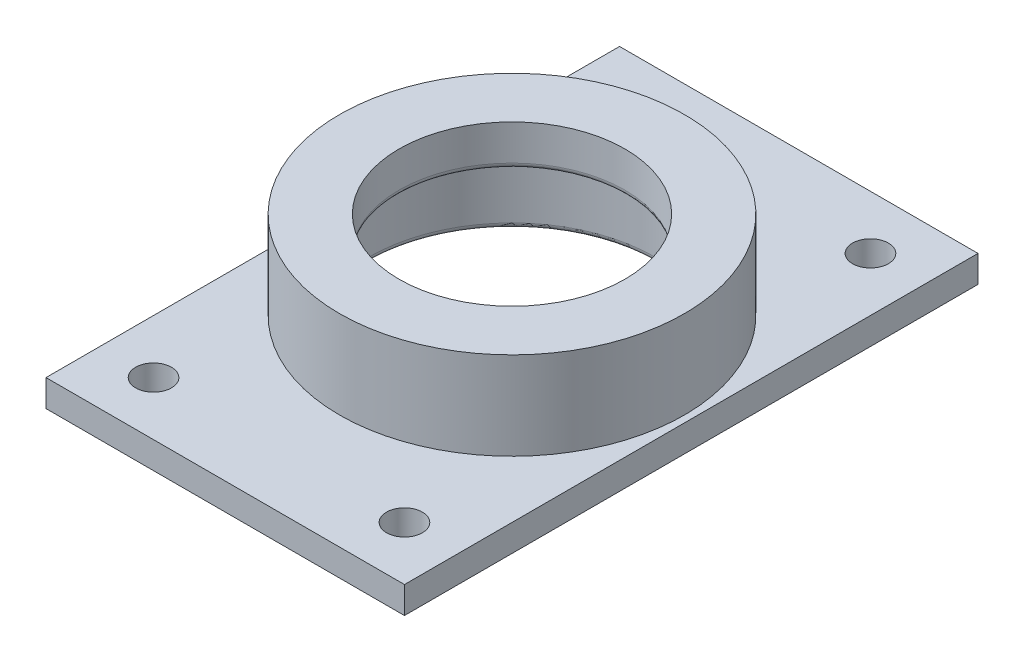
ISO-10303-21;
HEADER;
FILE_DESCRIPTION(('STEP AP214'),'2;1');
FILE_NAME('part.step','',(''),(''),'','','');
FILE_SCHEMA(('AUTOMOTIVE_DESIGN { 1 0 10303 214 1 1 1 1 }'));
ENDSEC;
DATA;
#1=APPLICATION_CONTEXT('core data for automotive mechanical design processes');
#2=APPLICATION_PROTOCOL_DEFINITION('international standard','automotive_design',2000,#1);
#3=PRODUCT_CONTEXT('',#1,'mechanical');
#4=PRODUCT('Part','Part','',(#3));
#5=PRODUCT_RELATED_PRODUCT_CATEGORY('part','',(#4));
#6=PRODUCT_DEFINITION_FORMATION('','',#4);
#7=PRODUCT_DEFINITION_CONTEXT('part definition',#1,'design');
#8=PRODUCT_DEFINITION('design','',#6,#7);
#9=PRODUCT_DEFINITION_SHAPE('','',#8);
#10=(LENGTH_UNIT() NAMED_UNIT(*) SI_UNIT(.MILLI.,.METRE.));
#11=(NAMED_UNIT(*) PLANE_ANGLE_UNIT() SI_UNIT($,.RADIAN.));
#12=(NAMED_UNIT(*) SI_UNIT($,.STERADIAN.) SOLID_ANGLE_UNIT());
#13=UNCERTAINTY_MEASURE_WITH_UNIT(LENGTH_MEASURE(1.E-05),#10,'distance_accuracy_value','');
#14=(GEOMETRIC_REPRESENTATION_CONTEXT(3) GLOBAL_UNCERTAINTY_ASSIGNED_CONTEXT((#13)) GLOBAL_UNIT_ASSIGNED_CONTEXT((#10,
#11,#12)) REPRESENTATION_CONTEXT('',''));
#15=CARTESIAN_POINT('',(0.,0.,0.));
#16=DIRECTION('',(0.,0.,1.));
#17=DIRECTION('',(1.,0.,0.));
#18=AXIS2_PLACEMENT_3D('',#15,#16,#17);
#19=CARTESIAN_POINT('',(0.,20.32,0.));
#20=DIRECTION('',(0.,-1.,0.));
#21=DIRECTION('',(0.,0.,-1.));
#22=AXIS2_PLACEMENT_3D('',#19,#20,#21);
#23=CYLINDRICAL_SURFACE('',#22,30.55);
#24=CARTESIAN_POINT('',(0.,4.7625,0.));
#25=DIRECTION('',(0.,1.,0.));
#26=DIRECTION('',(0.,0.,1.));
#27=AXIS2_PLACEMENT_3D('',#24,#25,#26);
#28=CIRCLE('',#27,30.55);
#29=CARTESIAN_POINT('',(0.,4.7625,30.55));
#30=VERTEX_POINT('',#29);
#31=EDGE_CURVE('E43',#30,#30,#28,.T.);
#32=ORIENTED_EDGE('',*,*,#31,.T.);
#33=EDGE_LOOP('',(#32));
#34=FACE_BOUND('',#33,.T.);
#35=CARTESIAN_POINT('',(0.,20.32,0.));
#36=DIRECTION('',(0.,1.,0.));
#37=DIRECTION('',(0.,0.,1.));
#38=AXIS2_PLACEMENT_3D('',#35,#36,#37);
#39=CIRCLE('',#38,30.55);
#40=CARTESIAN_POINT('',(0.,20.32,30.55));
#41=VERTEX_POINT('',#40);
#42=EDGE_CURVE('E142',#41,#41,#39,.T.);
#43=ORIENTED_EDGE('',*,*,#42,.F.);
#44=EDGE_LOOP('',(#43));
#45=FACE_BOUND('',#44,.T.);
#46=ADVANCED_FACE('F39',(#34,#45),#23,.T.);
#47=CARTESIAN_POINT('',(0.,20.32,0.));
#48=DIRECTION('',(0.,1.,0.));
#49=DIRECTION('',(0.,0.,1.));
#50=AXIS2_PLACEMENT_3D('',#47,#48,#49);
#51=PLANE('',#50);
#52=CARTESIAN_POINT('',(0.,20.32,0.));
#53=DIRECTION('',(0.,1.,0.));
#54=DIRECTION('',(0.,0.,1.));
#55=AXIS2_PLACEMENT_3D('',#52,#53,#54);
#56=CIRCLE('',#55,20.);
#57=CARTESIAN_POINT('',(0.,20.32,20.));
#58=VERTEX_POINT('',#57);
#59=EDGE_CURVE('E134',#58,#58,#56,.T.);
#60=ORIENTED_EDGE('',*,*,#59,.F.);
#61=EDGE_LOOP('',(#60));
#62=FACE_BOUND('',#61,.T.);
#63=ORIENTED_EDGE('',*,*,#42,.T.);
#64=EDGE_LOOP('',(#63));
#65=FACE_BOUND('',#64,.T.);
#66=ADVANCED_FACE('F175',(#62,#65),#51,.T.);
#67=CARTESIAN_POINT('',(0.,0.,0.));
#68=DIRECTION('',(0.,1.,0.));
#69=DIRECTION('',(0.,0.,1.));
#70=AXIS2_PLACEMENT_3D('',#67,#68,#69);
#71=PLANE('',#70);
#72=CARTESIAN_POINT('',(0.,0.,0.));
#73=DIRECTION('',(0.,1.,0.));
#74=DIRECTION('',(0.,0.,1.));
#75=AXIS2_PLACEMENT_3D('',#72,#73,#74);
#76=CIRCLE('',#75,26.404);
#77=CARTESIAN_POINT('',(0.,0.,26.404));
#78=VERTEX_POINT('',#77);
#79=EDGE_CURVE('E150',#78,#78,#76,.T.);
#80=ORIENTED_EDGE('',*,*,#79,.T.);
#81=EDGE_LOOP('',(#80));
#82=FACE_BOUND('',#81,.T.);
#83=DIRECTION('',(0.,0.,-1.));
#84=VECTOR('',#83,1.);
#85=CARTESIAN_POINT('',(-31.75,0.,50.8));
#86=LINE('',#85,#84);
#87=CARTESIAN_POINT('',(-31.75,0.,50.8));
#88=VERTEX_POINT('',#87);
#89=CARTESIAN_POINT('',(-31.75,0.,-50.8));
#90=VERTEX_POINT('',#89);
#91=EDGE_CURVE('E115',#88,#90,#86,.T.);
#92=ORIENTED_EDGE('',*,*,#91,.T.);
#93=DIRECTION('',(1.,0.,0.));
#94=VECTOR('',#93,1.);
#95=CARTESIAN_POINT('',(31.75,0.,-50.8));
#96=LINE('',#95,#94);
#97=CARTESIAN_POINT('',(31.75,0.,-50.8));
#98=VERTEX_POINT('',#97);
#99=EDGE_CURVE('E119',#90,#98,#96,.T.);
#100=ORIENTED_EDGE('',*,*,#99,.T.);
#101=DIRECTION('',(0.,0.,1.));
#102=VECTOR('',#101,1.);
#103=CARTESIAN_POINT('',(31.75,0.,50.8));
#104=LINE('',#103,#102);
#105=CARTESIAN_POINT('',(31.75,0.,50.8));
#106=VERTEX_POINT('',#105);
#107=EDGE_CURVE('E94',#98,#106,#104,.T.);
#108=ORIENTED_EDGE('',*,*,#107,.T.);
#109=DIRECTION('',(-1.,0.,0.));
#110=VECTOR('',#109,1.);
#111=CARTESIAN_POINT('',(31.75,0.,50.8));
#112=LINE('',#111,#110);
#113=EDGE_CURVE('E109',#106,#88,#112,.T.);
#114=ORIENTED_EDGE('',*,*,#113,.T.);
#115=EDGE_LOOP('',(#92,#100,#108,#114));
#116=FACE_BOUND('',#115,.T.);
#117=CARTESIAN_POINT('',(-22.225,0.,41.275));
#118=DIRECTION('',(0.,-1.,0.));
#119=DIRECTION('',(0.,0.,-1.));
#120=AXIS2_PLACEMENT_3D('',#117,#118,#119);
#121=CIRCLE('',#120,3.175);
#122=CARTESIAN_POINT('',(-22.225,0.,38.1));
#123=VERTEX_POINT('',#122);
#124=EDGE_CURVE('E252',#123,#123,#121,.T.);
#125=ORIENTED_EDGE('',*,*,#124,.F.);
#126=EDGE_LOOP('',(#125));
#127=FACE_BOUND('',#126,.T.);
#128=CARTESIAN_POINT('',(22.225,0.,41.275));
#129=DIRECTION('',(0.,-1.,0.));
#130=DIRECTION('',(0.,0.,1.));
#131=AXIS2_PLACEMENT_3D('',#128,#129,#130);
#132=CIRCLE('',#131,3.175);
#133=CARTESIAN_POINT('',(22.225,0.,44.45));
#134=VERTEX_POINT('',#133);
#135=EDGE_CURVE('E244',#134,#134,#132,.T.);
#136=ORIENTED_EDGE('',*,*,#135,.F.);
#137=EDGE_LOOP('',(#136));
#138=FACE_BOUND('',#137,.T.);
#139=CARTESIAN_POINT('',(22.225,0.,-41.275));
#140=DIRECTION('',(0.,-1.,0.));
#141=DIRECTION('',(0.,0.,-1.));
#142=AXIS2_PLACEMENT_3D('',#139,#140,#141);
#143=CIRCLE('',#142,3.175);
#144=CARTESIAN_POINT('',(22.225,0.,-44.45));
#145=VERTEX_POINT('',#144);
#146=EDGE_CURVE('E237',#145,#145,#143,.T.);
#147=ORIENTED_EDGE('',*,*,#146,.F.);
#148=EDGE_LOOP('',(#147));
#149=FACE_BOUND('',#148,.T.);
#150=CARTESIAN_POINT('',(-22.225,0.,-41.275));
#151=DIRECTION('',(0.,-1.,0.));
#152=DIRECTION('',(0.,0.,1.));
#153=AXIS2_PLACEMENT_3D('',#150,#151,#152);
#154=CIRCLE('',#153,3.175);
#155=CARTESIAN_POINT('',(-22.225,0.,-38.1));
#156=VERTEX_POINT('',#155);
#157=EDGE_CURVE('E232',#156,#156,#154,.T.);
#158=ORIENTED_EDGE('',*,*,#157,.F.);
#159=EDGE_LOOP('',(#158));
#160=FACE_BOUND('',#159,.T.);
#161=ADVANCED_FACE('F182',(#82,#116,#127,#138,#149,#160),#71,.F.);
#162=CARTESIAN_POINT('',(0.,13.,0.));
#163=DIRECTION('',(0.,-1.,0.));
#164=DIRECTION('',(0.,0.,-1.));
#165=AXIS2_PLACEMENT_3D('',#162,#163,#164);
#166=CYLINDRICAL_SURFACE('',#165,25.404);
#167=CARTESIAN_POINT('',(0.,0.999999999999999,0.));
#168=DIRECTION('',(0.,1.,0.));
#169=DIRECTION('',(0.,0.,1.));
#170=AXIS2_PLACEMENT_3D('',#167,#168,#169);
#171=CIRCLE('',#170,25.404);
#172=CARTESIAN_POINT('',(0.,0.999999999999999,25.404));
#173=VERTEX_POINT('',#172);
#174=EDGE_CURVE('E146',#173,#173,#171,.F.);
#175=ORIENTED_EDGE('',*,*,#174,.T.);
#176=EDGE_LOOP('',(#175));
#177=FACE_BOUND('',#176,.T.);
#178=CARTESIAN_POINT('',(0.,13.,0.));
#179=DIRECTION('',(0.,-1.,0.));
#180=DIRECTION('',(0.,0.,-1.));
#181=AXIS2_PLACEMENT_3D('',#178,#179,#180);
#182=CIRCLE('',#181,25.404);
#183=CARTESIAN_POINT('',(0.,13.,-25.404));
#184=VERTEX_POINT('',#183);
#185=EDGE_CURVE('E138',#184,#184,#182,.T.);
#186=ORIENTED_EDGE('',*,*,#185,.F.);
#187=EDGE_LOOP('',(#186));
#188=FACE_BOUND('',#187,.T.);
#189=ADVANCED_FACE('F188',(#177,#188),#166,.F.);
#190=CARTESIAN_POINT('',(0.,13.,0.));
#191=DIRECTION('',(0.,-1.,0.));
#192=DIRECTION('',(0.,0.,-1.));
#193=AXIS2_PLACEMENT_3D('',#190,#191,#192);
#194=PLANE('',#193);
#195=CARTESIAN_POINT('',(0.,13.,0.));
#196=DIRECTION('',(0.,-1.,0.));
#197=DIRECTION('',(0.,0.,-1.));
#198=AXIS2_PLACEMENT_3D('',#195,#196,#197);
#199=CIRCLE('',#198,21.);
#200=CARTESIAN_POINT('',(0.,13.,-21.));
#201=VERTEX_POINT('',#200);
#202=EDGE_CURVE('E11',#201,#201,#199,.F.);
#203=ORIENTED_EDGE('',*,*,#202,.T.);
#204=EDGE_LOOP('',(#203));
#205=FACE_BOUND('',#204,.T.);
#206=ORIENTED_EDGE('',*,*,#185,.T.);
#207=EDGE_LOOP('',(#206));
#208=FACE_BOUND('',#207,.T.);
#209=ADVANCED_FACE('F193',(#205,#208),#194,.T.);
#210=CARTESIAN_POINT('',(0.,0.,0.));
#211=DIRECTION('',(0.,1.,0.));
#212=DIRECTION('',(0.,0.,1.));
#213=AXIS2_PLACEMENT_3D('',#210,#211,#212);
#214=CYLINDRICAL_SURFACE('',#213,20.);
#215=CARTESIAN_POINT('',(0.,14.,0.));
#216=DIRECTION('',(0.,-1.,0.));
#217=DIRECTION('',(0.,0.,-1.));
#218=AXIS2_PLACEMENT_3D('',#215,#216,#217);
#219=CIRCLE('',#218,20.);
#220=CARTESIAN_POINT('',(0.,14.,-20.));
#221=VERTEX_POINT('',#220);
#222=EDGE_CURVE('E50',#221,#221,#219,.T.);
#223=ORIENTED_EDGE('',*,*,#222,.T.);
#224=EDGE_LOOP('',(#223));
#225=FACE_BOUND('',#224,.T.);
#226=ORIENTED_EDGE('',*,*,#59,.T.);
#227=EDGE_LOOP('',(#226));
#228=FACE_BOUND('',#227,.T.);
#229=ADVANCED_FACE('F158',(#225,#228),#214,.F.);
#230=CARTESIAN_POINT('',(0.,0.999999999999999,0.));
#231=DIRECTION('',(0.,1.,0.));
#232=DIRECTION('',(0.,0.,1.));
#233=AXIS2_PLACEMENT_3D('',#230,#231,#232);
#234=TOROIDAL_SURFACE('',#233,26.404,1.);
#235=ORIENTED_EDGE('',*,*,#79,.F.);
#236=EDGE_LOOP('',(#235));
#237=FACE_BOUND('',#236,.T.);
#238=ORIENTED_EDGE('',*,*,#174,.F.);
#239=EDGE_LOOP('',(#238));
#240=FACE_BOUND('',#239,.T.);
#241=ADVANCED_FACE('F163',(#237,#240),#234,.T.);
#242=CARTESIAN_POINT('',(0.,14.,0.));
#243=DIRECTION('',(0.,-1.,0.));
#244=DIRECTION('',(0.,0.,-1.));
#245=AXIS2_PLACEMENT_3D('',#242,#243,#244);
#246=TOROIDAL_SURFACE('',#245,21.,1.);
#247=ORIENTED_EDGE('',*,*,#202,.F.);
#248=EDGE_LOOP('',(#247));
#249=FACE_BOUND('',#248,.T.);
#250=ORIENTED_EDGE('',*,*,#222,.F.);
#251=EDGE_LOOP('',(#250));
#252=FACE_BOUND('',#251,.T.);
#253=ADVANCED_FACE('F41',(#249,#252),#246,.T.);
#254=CARTESIAN_POINT('',(-31.75,4.7625,50.8));
#255=DIRECTION('',(-1.,0.,0.));
#256=DIRECTION('',(0.,0.,1.));
#257=AXIS2_PLACEMENT_3D('',#254,#255,#256);
#258=PLANE('',#257);
#259=ORIENTED_EDGE('',*,*,#91,.F.);
#260=DIRECTION('',(0.,-1.,0.));
#261=VECTOR('',#260,1.);
#262=CARTESIAN_POINT('',(-31.75,4.7625,50.8));
#263=LINE('',#262,#261);
#264=CARTESIAN_POINT('',(-31.75,4.7625,50.8));
#265=VERTEX_POINT('',#264);
#266=EDGE_CURVE('E58',#265,#88,#263,.T.);
#267=ORIENTED_EDGE('',*,*,#266,.F.);
#268=DIRECTION('',(0.,0.,-1.));
#269=VECTOR('',#268,1.);
#270=CARTESIAN_POINT('',(-31.75,4.7625,50.8));
#271=LINE('',#270,#269);
#272=CARTESIAN_POINT('',(-31.75,4.7625,-50.8));
#273=VERTEX_POINT('',#272);
#274=EDGE_CURVE('E106',#265,#273,#271,.T.);
#275=ORIENTED_EDGE('',*,*,#274,.T.);
#276=DIRECTION('',(0.,-1.,0.));
#277=VECTOR('',#276,1.);
#278=CARTESIAN_POINT('',(-31.75,4.7625,-50.8));
#279=LINE('',#278,#277);
#280=EDGE_CURVE('E86',#273,#90,#279,.T.);
#281=ORIENTED_EDGE('',*,*,#280,.T.);
#282=EDGE_LOOP('',(#259,#267,#275,#281));
#283=FACE_BOUND('',#282,.T.);
#284=ADVANCED_FACE('F162',(#283),#258,.T.);
#285=CARTESIAN_POINT('',(31.75,4.7625,50.8));
#286=DIRECTION('',(0.,0.,1.));
#287=DIRECTION('',(1.,0.,0.));
#288=AXIS2_PLACEMENT_3D('',#285,#286,#287);
#289=PLANE('',#288);
#290=ORIENTED_EDGE('',*,*,#113,.F.);
#291=DIRECTION('',(0.,-1.,0.));
#292=VECTOR('',#291,1.);
#293=CARTESIAN_POINT('',(31.75,4.7625,50.8));
#294=LINE('',#293,#292);
#295=CARTESIAN_POINT('',(31.75,4.7625,50.8));
#296=VERTEX_POINT('',#295);
#297=EDGE_CURVE('E75',#296,#106,#294,.T.);
#298=ORIENTED_EDGE('',*,*,#297,.F.);
#299=DIRECTION('',(-1.,0.,0.));
#300=VECTOR('',#299,1.);
#301=CARTESIAN_POINT('',(31.75,4.7625,50.8));
#302=LINE('',#301,#300);
#303=EDGE_CURVE('E101',#296,#265,#302,.T.);
#304=ORIENTED_EDGE('',*,*,#303,.T.);
#305=ORIENTED_EDGE('',*,*,#266,.T.);
#306=EDGE_LOOP('',(#290,#298,#304,#305));
#307=FACE_BOUND('',#306,.T.);
#308=ADVANCED_FACE('F170',(#307),#289,.T.);
#309=CARTESIAN_POINT('',(31.75,4.7625,50.8));
#310=DIRECTION('',(1.,0.,0.));
#311=DIRECTION('',(0.,0.,-1.));
#312=AXIS2_PLACEMENT_3D('',#309,#310,#311);
#313=PLANE('',#312);
#314=ORIENTED_EDGE('',*,*,#107,.F.);
#315=DIRECTION('',(0.,-1.,0.));
#316=VECTOR('',#315,1.);
#317=CARTESIAN_POINT('',(31.75,4.7625,-50.8));
#318=LINE('',#317,#316);
#319=CARTESIAN_POINT('',(31.75,4.7625,-50.8));
#320=VERTEX_POINT('',#319);
#321=EDGE_CURVE('E89',#320,#98,#318,.T.);
#322=ORIENTED_EDGE('',*,*,#321,.F.);
#323=DIRECTION('',(0.,0.,1.));
#324=VECTOR('',#323,1.);
#325=CARTESIAN_POINT('',(31.75,4.7625,50.8));
#326=LINE('',#325,#324);
#327=EDGE_CURVE('E92',#320,#296,#326,.T.);
#328=ORIENTED_EDGE('',*,*,#327,.T.);
#329=ORIENTED_EDGE('',*,*,#297,.T.);
#330=EDGE_LOOP('',(#314,#322,#328,#329));
#331=FACE_BOUND('',#330,.T.);
#332=ADVANCED_FACE('F91',(#331),#313,.T.);
#333=CARTESIAN_POINT('',(31.75,4.7625,-50.8));
#334=DIRECTION('',(0.,0.,-1.));
#335=DIRECTION('',(-1.,0.,0.));
#336=AXIS2_PLACEMENT_3D('',#333,#334,#335);
#337=PLANE('',#336);
#338=ORIENTED_EDGE('',*,*,#99,.F.);
#339=ORIENTED_EDGE('',*,*,#280,.F.);
#340=DIRECTION('',(1.,0.,0.));
#341=VECTOR('',#340,1.);
#342=CARTESIAN_POINT('',(31.75,4.7625,-50.8));
#343=LINE('',#342,#341);
#344=EDGE_CURVE('E100',#273,#320,#343,.T.);
#345=ORIENTED_EDGE('',*,*,#344,.T.);
#346=ORIENTED_EDGE('',*,*,#321,.T.);
#347=EDGE_LOOP('',(#338,#339,#345,#346));
#348=FACE_BOUND('',#347,.T.);
#349=ADVANCED_FACE('F104',(#348),#337,.T.);
#350=CARTESIAN_POINT('',(0.,4.7625,0.));
#351=DIRECTION('',(0.,1.,0.));
#352=DIRECTION('',(0.,0.,1.));
#353=AXIS2_PLACEMENT_3D('',#350,#351,#352);
#354=PLANE('',#353);
#355=ORIENTED_EDGE('',*,*,#31,.F.);
#356=EDGE_LOOP('',(#355));
#357=FACE_BOUND('',#356,.T.);
#358=CARTESIAN_POINT('',(-22.225,4.7625,-41.275));
#359=DIRECTION('',(0.,-1.,0.));
#360=DIRECTION('',(0.,0.,1.));
#361=AXIS2_PLACEMENT_3D('',#358,#359,#360);
#362=CIRCLE('',#361,3.175);
#363=CARTESIAN_POINT('',(-22.225,4.7625,-38.1));
#364=VERTEX_POINT('',#363);
#365=EDGE_CURVE('E229',#364,#364,#362,.T.);
#366=ORIENTED_EDGE('',*,*,#365,.T.);
#367=EDGE_LOOP('',(#366));
#368=FACE_BOUND('',#367,.T.);
#369=CARTESIAN_POINT('',(22.225,4.7625,-41.275));
#370=DIRECTION('',(0.,-1.,0.));
#371=DIRECTION('',(0.,0.,-1.));
#372=AXIS2_PLACEMENT_3D('',#369,#370,#371);
#373=CIRCLE('',#372,3.175);
#374=CARTESIAN_POINT('',(22.225,4.7625,-44.45));
#375=VERTEX_POINT('',#374);
#376=EDGE_CURVE('E240',#375,#375,#373,.T.);
#377=ORIENTED_EDGE('',*,*,#376,.T.);
#378=EDGE_LOOP('',(#377));
#379=FACE_BOUND('',#378,.T.);
#380=CARTESIAN_POINT('',(22.225,4.7625,41.275));
#381=DIRECTION('',(0.,-1.,0.));
#382=DIRECTION('',(0.,0.,1.));
#383=AXIS2_PLACEMENT_3D('',#380,#381,#382);
#384=CIRCLE('',#383,3.175);
#385=CARTESIAN_POINT('',(22.225,4.7625,44.45));
#386=VERTEX_POINT('',#385);
#387=EDGE_CURVE('E248',#386,#386,#384,.T.);
#388=ORIENTED_EDGE('',*,*,#387,.T.);
#389=EDGE_LOOP('',(#388));
#390=FACE_BOUND('',#389,.T.);
#391=CARTESIAN_POINT('',(-22.225,4.7625,41.275));
#392=DIRECTION('',(0.,-1.,0.));
#393=DIRECTION('',(0.,0.,-1.));
#394=AXIS2_PLACEMENT_3D('',#391,#392,#393);
#395=CIRCLE('',#394,3.175);
#396=CARTESIAN_POINT('',(-22.225,4.7625,38.1));
#397=VERTEX_POINT('',#396);
#398=EDGE_CURVE('E120',#397,#397,#395,.T.);
#399=ORIENTED_EDGE('',*,*,#398,.T.);
#400=EDGE_LOOP('',(#399));
#401=FACE_BOUND('',#400,.T.);
#402=ORIENTED_EDGE('',*,*,#274,.F.);
#403=ORIENTED_EDGE('',*,*,#303,.F.);
#404=ORIENTED_EDGE('',*,*,#327,.F.);
#405=ORIENTED_EDGE('',*,*,#344,.F.);
#406=EDGE_LOOP('',(#402,#403,#404,#405));
#407=FACE_BOUND('',#406,.T.);
#408=ADVANCED_FACE('F99',(#357,#368,#379,#390,#401,#407),#354,.T.);
#409=CARTESIAN_POINT('',(-22.225,4.7625,41.275));
#410=DIRECTION('',(0.,-1.,0.));
#411=DIRECTION('',(0.,0.,-1.));
#412=AXIS2_PLACEMENT_3D('',#409,#410,#411);
#413=CYLINDRICAL_SURFACE('',#412,3.175);
#414=ORIENTED_EDGE('',*,*,#398,.F.);
#415=EDGE_LOOP('',(#414));
#416=FACE_BOUND('',#415,.T.);
#417=ORIENTED_EDGE('',*,*,#124,.T.);
#418=EDGE_LOOP('',(#417));
#419=FACE_BOUND('',#418,.T.);
#420=ADVANCED_FACE('F208',(#416,#419),#413,.F.);
#421=CARTESIAN_POINT('',(22.225,4.7625,41.275));
#422=DIRECTION('',(0.,-1.,0.));
#423=DIRECTION('',(0.,0.,-1.));
#424=AXIS2_PLACEMENT_3D('',#421,#422,#423);
#425=CYLINDRICAL_SURFACE('',#424,3.175);
#426=ORIENTED_EDGE('',*,*,#387,.F.);
#427=EDGE_LOOP('',(#426));
#428=FACE_BOUND('',#427,.T.);
#429=ORIENTED_EDGE('',*,*,#135,.T.);
#430=EDGE_LOOP('',(#429));
#431=FACE_BOUND('',#430,.T.);
#432=ADVANCED_FACE('F212',(#428,#431),#425,.F.);
#433=CARTESIAN_POINT('',(22.225,4.7625,-41.275));
#434=DIRECTION('',(0.,-1.,0.));
#435=DIRECTION('',(0.,0.,-1.));
#436=AXIS2_PLACEMENT_3D('',#433,#434,#435);
#437=CYLINDRICAL_SURFACE('',#436,3.175);
#438=ORIENTED_EDGE('',*,*,#376,.F.);
#439=EDGE_LOOP('',(#438));
#440=FACE_BOUND('',#439,.T.);
#441=ORIENTED_EDGE('',*,*,#146,.T.);
#442=EDGE_LOOP('',(#441));
#443=FACE_BOUND('',#442,.T.);
#444=ADVANCED_FACE('F216',(#440,#443),#437,.F.);
#445=CARTESIAN_POINT('',(-22.225,4.7625,-41.275));
#446=DIRECTION('',(0.,-1.,0.));
#447=DIRECTION('',(0.,0.,-1.));
#448=AXIS2_PLACEMENT_3D('',#445,#446,#447);
#449=CYLINDRICAL_SURFACE('',#448,3.175);
#450=ORIENTED_EDGE('',*,*,#365,.F.);
#451=EDGE_LOOP('',(#450));
#452=FACE_BOUND('',#451,.T.);
#453=ORIENTED_EDGE('',*,*,#157,.T.);
#454=EDGE_LOOP('',(#453));
#455=FACE_BOUND('',#454,.T.);
#456=ADVANCED_FACE('F220',(#452,#455),#449,.F.);
#457=CLOSED_SHELL('',(#46,#66,#161,#189,#209,#229,#241,#253,#284,#308,#332,#349,#408,#420,#432,
#444,#456));
#458=MANIFOLD_SOLID_BREP('B2',#457);
#459=ADVANCED_BREP_SHAPE_REPRESENTATION('',(#18,#458),#14);
#460=SHAPE_DEFINITION_REPRESENTATION(#9,#459);
ENDSEC;
END-ISO-10303-21;
